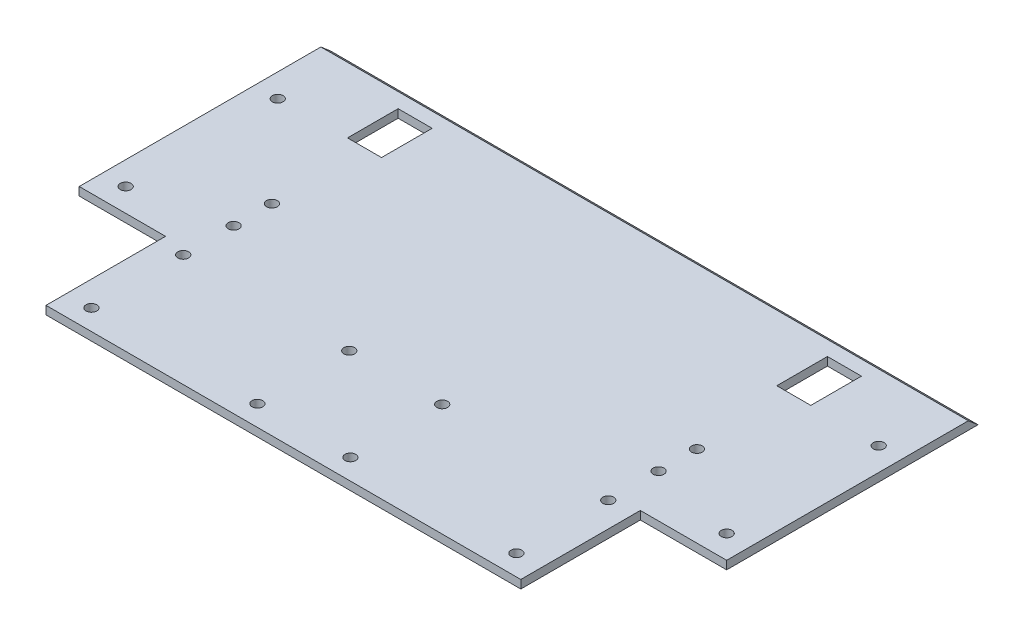
ISO-10303-21;
HEADER;
FILE_DESCRIPTION(('STEP AP214'),'2;1');
FILE_NAME('part.step','',(''),(''),'','','');
FILE_SCHEMA(('AUTOMOTIVE_DESIGN { 1 0 10303 214 1 1 1 1 }'));
ENDSEC;
DATA;
#1=APPLICATION_CONTEXT('core data for automotive mechanical design processes');
#2=APPLICATION_PROTOCOL_DEFINITION('international standard','automotive_design',2000,#1);
#3=PRODUCT_CONTEXT('',#1,'mechanical');
#4=PRODUCT('Part','Part','',(#3));
#5=PRODUCT_RELATED_PRODUCT_CATEGORY('part','',(#4));
#6=PRODUCT_DEFINITION_FORMATION('','',#4);
#7=PRODUCT_DEFINITION_CONTEXT('part definition',#1,'design');
#8=PRODUCT_DEFINITION('design','',#6,#7);
#9=PRODUCT_DEFINITION_SHAPE('','',#8);
#10=(LENGTH_UNIT() NAMED_UNIT(*) SI_UNIT(.MILLI.,.METRE.));
#11=(NAMED_UNIT(*) PLANE_ANGLE_UNIT() SI_UNIT($,.RADIAN.));
#12=(NAMED_UNIT(*) SI_UNIT($,.STERADIAN.) SOLID_ANGLE_UNIT());
#13=UNCERTAINTY_MEASURE_WITH_UNIT(LENGTH_MEASURE(1.E-05),#10,'distance_accuracy_value','');
#14=(GEOMETRIC_REPRESENTATION_CONTEXT(3) GLOBAL_UNCERTAINTY_ASSIGNED_CONTEXT((#13)) GLOBAL_UNIT_ASSIGNED_CONTEXT((#10,
#11,#12)) REPRESENTATION_CONTEXT('',''));
#15=CARTESIAN_POINT('',(0.,0.,0.));
#16=DIRECTION('',(0.,0.,1.));
#17=DIRECTION('',(1.,0.,0.));
#18=AXIS2_PLACEMENT_3D('',#15,#16,#17);
#19=CARTESIAN_POINT('',(-97.5,2.5,0.));
#20=DIRECTION('',(-1.,0.,0.));
#21=DIRECTION('',(0.,0.,1.));
#22=AXIS2_PLACEMENT_3D('',#19,#20,#21);
#23=PLANE('',#22);
#24=DIRECTION('',(0.,0.,-1.));
#25=VECTOR('',#24,1.);
#26=CARTESIAN_POINT('',(-97.5,0.,0.));
#27=LINE('',#26,#25);
#28=CARTESIAN_POINT('',(-97.5,0.,25.0000000000045));
#29=VERTEX_POINT('',#28);
#30=CARTESIAN_POINT('',(-97.5,0.,-50.6999999999954));
#31=VERTEX_POINT('',#30);
#32=EDGE_CURVE('E278',#29,#31,#27,.T.);
#33=ORIENTED_EDGE('',*,*,#32,.F.);
#34=DIRECTION('',(0.,-1.,0.));
#35=VECTOR('',#34,1.);
#36=CARTESIAN_POINT('',(-97.5,2.5,25.0000000000045));
#37=LINE('',#36,#35);
#38=CARTESIAN_POINT('',(-97.5,2.5,25.0000000000045));
#39=VERTEX_POINT('',#38);
#40=EDGE_CURVE('E13',#39,#29,#37,.T.);
#41=ORIENTED_EDGE('',*,*,#40,.F.);
#42=DIRECTION('',(0.,0.,-1.));
#43=VECTOR('',#42,1.);
#44=CARTESIAN_POINT('',(-97.5,2.5,0.));
#45=LINE('',#44,#43);
#46=CARTESIAN_POINT('',(-97.5,2.50000000000003,-47.7831999517202));
#47=VERTEX_POINT('',#46);
#48=EDGE_CURVE('E281',#39,#47,#45,.T.);
#49=ORIENTED_EDGE('',*,*,#48,.T.);
#50=DIRECTION('',(0.,0.650774217265846,0.759271307334885));
#51=VECTOR('',#50,1.);
#52=CARTESIAN_POINT('',(-97.5,2.50000000000001,-47.7831999517203));
#53=LINE('',#52,#51);
#54=EDGE_CURVE('E272',#31,#47,#53,.T.);
#55=ORIENTED_EDGE('',*,*,#54,.F.);
#56=EDGE_LOOP('',(#33,#41,#49,#55));
#57=FACE_BOUND('',#56,.T.);
#58=ADVANCED_FACE('F46',(#57),#23,.T.);
#59=CARTESIAN_POINT('',(0.,2.5,25.0000000000045));
#60=DIRECTION('',(0.,0.,1.));
#61=DIRECTION('',(1.,0.,0.));
#62=AXIS2_PLACEMENT_3D('',#59,#60,#61);
#63=PLANE('',#62);
#64=DIRECTION('',(-1.,0.,0.));
#65=VECTOR('',#64,1.);
#66=CARTESIAN_POINT('',(0.,0.,25.0000000000045));
#67=LINE('',#66,#65);
#68=CARTESIAN_POINT('',(-71.5,0.,25.0000000000045));
#69=VERTEX_POINT('',#68);
#70=EDGE_CURVE('E306',#69,#29,#67,.T.);
#71=ORIENTED_EDGE('',*,*,#70,.F.);
#72=DIRECTION('',(0.,-1.,0.));
#73=VECTOR('',#72,1.);
#74=CARTESIAN_POINT('',(-71.5,2.5,25.0000000000045));
#75=LINE('',#74,#73);
#76=CARTESIAN_POINT('',(-71.5,2.5,25.0000000000045));
#77=VERTEX_POINT('',#76);
#78=EDGE_CURVE('E54',#77,#69,#75,.T.);
#79=ORIENTED_EDGE('',*,*,#78,.F.);
#80=DIRECTION('',(-1.,0.,0.));
#81=VECTOR('',#80,1.);
#82=CARTESIAN_POINT('',(0.,2.5,25.0000000000045));
#83=LINE('',#82,#81);
#84=EDGE_CURVE('E283',#77,#39,#83,.T.);
#85=ORIENTED_EDGE('',*,*,#84,.T.);
#86=ORIENTED_EDGE('',*,*,#40,.T.);
#87=EDGE_LOOP('',(#71,#79,#85,#86));
#88=FACE_BOUND('',#87,.T.);
#89=ADVANCED_FACE('F431',(#88),#63,.T.);
#90=CARTESIAN_POINT('',(-71.5,2.5,0.));
#91=DIRECTION('',(-1.,0.,0.));
#92=DIRECTION('',(0.,0.,1.));
#93=AXIS2_PLACEMENT_3D('',#90,#91,#92);
#94=PLANE('',#93);
#95=DIRECTION('',(0.,0.,-1.));
#96=VECTOR('',#95,1.);
#97=CARTESIAN_POINT('',(-71.5,0.,0.));
#98=LINE('',#97,#96);
#99=CARTESIAN_POINT('',(-71.5,0.,61.0000000000045));
#100=VERTEX_POINT('',#99);
#101=EDGE_CURVE('E309',#100,#69,#98,.T.);
#102=ORIENTED_EDGE('',*,*,#101,.F.);
#103=DIRECTION('',(0.,-1.,0.));
#104=VECTOR('',#103,1.);
#105=CARTESIAN_POINT('',(-71.5,2.5,61.0000000000045));
#106=LINE('',#105,#104);
#107=CARTESIAN_POINT('',(-71.5,2.5,61.0000000000045));
#108=VERTEX_POINT('',#107);
#109=EDGE_CURVE('E333',#108,#100,#106,.T.);
#110=ORIENTED_EDGE('',*,*,#109,.F.);
#111=DIRECTION('',(0.,0.,-1.));
#112=VECTOR('',#111,1.);
#113=CARTESIAN_POINT('',(-71.5,2.5,0.));
#114=LINE('',#113,#112);
#115=EDGE_CURVE('E287',#108,#77,#114,.T.);
#116=ORIENTED_EDGE('',*,*,#115,.T.);
#117=ORIENTED_EDGE('',*,*,#78,.T.);
#118=EDGE_LOOP('',(#102,#110,#116,#117));
#119=FACE_BOUND('',#118,.T.);
#120=ADVANCED_FACE('F436',(#119),#94,.T.);
#121=CARTESIAN_POINT('',(0.,2.5,61.0000000000045));
#122=DIRECTION('',(0.,0.,-1.));
#123=DIRECTION('',(-1.,0.,0.));
#124=AXIS2_PLACEMENT_3D('',#121,#122,#123);
#125=PLANE('',#124);
#126=DIRECTION('',(1.,0.,0.));
#127=VECTOR('',#126,1.);
#128=CARTESIAN_POINT('',(0.,0.,61.0000000000045));
#129=LINE('',#128,#127);
#130=CARTESIAN_POINT('',(71.5,0.,61.0000000000045));
#131=VERTEX_POINT('',#130);
#132=EDGE_CURVE('E312',#100,#131,#129,.T.);
#133=ORIENTED_EDGE('',*,*,#132,.T.);
#134=DIRECTION('',(0.,-1.,0.));
#135=VECTOR('',#134,1.);
#136=CARTESIAN_POINT('',(71.5,2.5,61.0000000000045));
#137=LINE('',#136,#135);
#138=CARTESIAN_POINT('',(71.5,2.5,61.0000000000045));
#139=VERTEX_POINT('',#138);
#140=EDGE_CURVE('E330',#139,#131,#137,.T.);
#141=ORIENTED_EDGE('',*,*,#140,.F.);
#142=DIRECTION('',(1.,0.,0.));
#143=VECTOR('',#142,1.);
#144=CARTESIAN_POINT('',(0.,2.5,61.0000000000045));
#145=LINE('',#144,#143);
#146=EDGE_CURVE('E290',#108,#139,#145,.T.);
#147=ORIENTED_EDGE('',*,*,#146,.F.);
#148=ORIENTED_EDGE('',*,*,#109,.T.);
#149=EDGE_LOOP('',(#133,#141,#147,#148));
#150=FACE_BOUND('',#149,.T.);
#151=ADVANCED_FACE('F452',(#150),#125,.F.);
#152=CARTESIAN_POINT('',(71.5,2.5,0.));
#153=DIRECTION('',(-1.,0.,0.));
#154=DIRECTION('',(0.,0.,1.));
#155=AXIS2_PLACEMENT_3D('',#152,#153,#154);
#156=PLANE('',#155);
#157=DIRECTION('',(0.,0.,-1.));
#158=VECTOR('',#157,1.);
#159=CARTESIAN_POINT('',(71.5,0.,0.));
#160=LINE('',#159,#158);
#161=CARTESIAN_POINT('',(71.5,0.,25.0000000000045));
#162=VERTEX_POINT('',#161);
#163=EDGE_CURVE('E314',#131,#162,#160,.T.);
#164=ORIENTED_EDGE('',*,*,#163,.T.);
#165=DIRECTION('',(0.,-1.,0.));
#166=VECTOR('',#165,1.);
#167=CARTESIAN_POINT('',(71.5,2.5,25.0000000000045));
#168=LINE('',#167,#166);
#169=CARTESIAN_POINT('',(71.5,2.5,25.0000000000045));
#170=VERTEX_POINT('',#169);
#171=EDGE_CURVE('E327',#170,#162,#168,.T.);
#172=ORIENTED_EDGE('',*,*,#171,.F.);
#173=DIRECTION('',(0.,0.,-1.));
#174=VECTOR('',#173,1.);
#175=CARTESIAN_POINT('',(71.5,2.5,0.));
#176=LINE('',#175,#174);
#177=EDGE_CURVE('E292',#139,#170,#176,.T.);
#178=ORIENTED_EDGE('',*,*,#177,.F.);
#179=ORIENTED_EDGE('',*,*,#140,.T.);
#180=EDGE_LOOP('',(#164,#172,#178,#179));
#181=FACE_BOUND('',#180,.T.);
#182=ADVANCED_FACE('F458',(#181),#156,.F.);
#183=CARTESIAN_POINT('',(0.,2.5,25.0000000000045));
#184=DIRECTION('',(0.,0.,-1.));
#185=DIRECTION('',(-1.,0.,0.));
#186=AXIS2_PLACEMENT_3D('',#183,#184,#185);
#187=PLANE('',#186);
#188=DIRECTION('',(1.,0.,0.));
#189=VECTOR('',#188,1.);
#190=CARTESIAN_POINT('',(0.,0.,25.0000000000045));
#191=LINE('',#190,#189);
#192=CARTESIAN_POINT('',(97.5,0.,25.0000000000045));
#193=VERTEX_POINT('',#192);
#194=EDGE_CURVE('E316',#162,#193,#191,.T.);
#195=ORIENTED_EDGE('',*,*,#194,.T.);
#196=DIRECTION('',(0.,-1.,0.));
#197=VECTOR('',#196,1.);
#198=CARTESIAN_POINT('',(97.5,2.5,25.0000000000045));
#199=LINE('',#198,#197);
#200=CARTESIAN_POINT('',(97.5,2.5,25.0000000000045));
#201=VERTEX_POINT('',#200);
#202=EDGE_CURVE('E304',#201,#193,#199,.T.);
#203=ORIENTED_EDGE('',*,*,#202,.F.);
#204=DIRECTION('',(1.,0.,0.));
#205=VECTOR('',#204,1.);
#206=CARTESIAN_POINT('',(0.,2.5,25.0000000000045));
#207=LINE('',#206,#205);
#208=EDGE_CURVE('E294',#170,#201,#207,.T.);
#209=ORIENTED_EDGE('',*,*,#208,.F.);
#210=ORIENTED_EDGE('',*,*,#171,.T.);
#211=EDGE_LOOP('',(#195,#203,#209,#210));
#212=FACE_BOUND('',#211,.T.);
#213=ADVANCED_FACE('F462',(#212),#187,.F.);
#214=CARTESIAN_POINT('',(90.5,2.5,18.0000000000045));
#215=DIRECTION('',(0.,-1.,0.));
#216=DIRECTION('',(0.,0.,-1.));
#217=AXIS2_PLACEMENT_3D('',#214,#215,#216);
#218=CYLINDRICAL_SURFACE('',#217,1.625);
#219=CARTESIAN_POINT('',(90.5,2.5,18.0000000000045));
#220=DIRECTION('',(0.,1.,0.));
#221=DIRECTION('',(0.,0.,1.));
#222=AXIS2_PLACEMENT_3D('',#219,#220,#221);
#223=CIRCLE('',#222,1.625);
#224=CARTESIAN_POINT('',(90.5,2.5,19.6250000000045));
#225=VERTEX_POINT('',#224);
#226=EDGE_CURVE('E298',#225,#225,#223,.T.);
#227=ORIENTED_EDGE('',*,*,#226,.T.);
#228=EDGE_LOOP('',(#227));
#229=FACE_BOUND('',#228,.T.);
#230=CARTESIAN_POINT('',(90.5,0.,18.0000000000045));
#231=DIRECTION('',(0.,1.,0.));
#232=DIRECTION('',(0.,0.,1.));
#233=AXIS2_PLACEMENT_3D('',#230,#231,#232);
#234=CIRCLE('',#233,1.625);
#235=CARTESIAN_POINT('',(90.5,0.,19.6250000000045));
#236=VERTEX_POINT('',#235);
#237=EDGE_CURVE('E320',#236,#236,#234,.T.);
#238=ORIENTED_EDGE('',*,*,#237,.F.);
#239=EDGE_LOOP('',(#238));
#240=FACE_BOUND('',#239,.T.);
#241=ADVANCED_FACE('F425',(#229,#240),#218,.F.);
#242=CARTESIAN_POINT('',(97.5,2.5,0.));
#243=DIRECTION('',(-1.,0.,0.));
#244=DIRECTION('',(0.,0.,1.));
#245=AXIS2_PLACEMENT_3D('',#242,#243,#244);
#246=PLANE('',#245);
#247=DIRECTION('',(0.,0.,-1.));
#248=VECTOR('',#247,1.);
#249=CARTESIAN_POINT('',(97.5,0.,0.));
#250=LINE('',#249,#248);
#251=CARTESIAN_POINT('',(97.5,0.,-50.6999999999955));
#252=VERTEX_POINT('',#251);
#253=EDGE_CURVE('E318',#193,#252,#250,.T.);
#254=ORIENTED_EDGE('',*,*,#253,.T.);
#255=DIRECTION('',(0.,0.650774217265846,0.759271307334885));
#256=VECTOR('',#255,1.);
#257=CARTESIAN_POINT('',(97.5,2.5,-47.7831999517204));
#258=LINE('',#257,#256);
#259=CARTESIAN_POINT('',(97.5,2.5,-47.7831999517204));
#260=VERTEX_POINT('',#259);
#261=EDGE_CURVE('E267',#252,#260,#258,.T.);
#262=ORIENTED_EDGE('',*,*,#261,.T.);
#263=DIRECTION('',(0.,0.,-1.));
#264=VECTOR('',#263,1.);
#265=CARTESIAN_POINT('',(97.5,2.5,0.));
#266=LINE('',#265,#264);
#267=EDGE_CURVE('E296',#201,#260,#266,.T.);
#268=ORIENTED_EDGE('',*,*,#267,.F.);
#269=ORIENTED_EDGE('',*,*,#202,.T.);
#270=EDGE_LOOP('',(#254,#262,#268,#269));
#271=FACE_BOUND('',#270,.T.);
#272=ADVANCED_FACE('F416',(#271),#246,.F.);
#273=CARTESIAN_POINT('',(-90.5,2.5,18.0000000000045));
#274=DIRECTION('',(0.,-1.,0.));
#275=DIRECTION('',(0.,0.,-1.));
#276=AXIS2_PLACEMENT_3D('',#273,#274,#275);
#277=CYLINDRICAL_SURFACE('',#276,1.625);
#278=CARTESIAN_POINT('',(-90.5,2.5,18.0000000000045));
#279=DIRECTION('',(0.,1.,0.));
#280=DIRECTION('',(0.,0.,1.));
#281=AXIS2_PLACEMENT_3D('',#278,#279,#280);
#282=CIRCLE('',#281,1.625);
#283=CARTESIAN_POINT('',(-90.5,2.5,19.6250000000045));
#284=VERTEX_POINT('',#283);
#285=EDGE_CURVE('E301',#284,#284,#282,.F.);
#286=ORIENTED_EDGE('',*,*,#285,.F.);
#287=EDGE_LOOP('',(#286));
#288=FACE_BOUND('',#287,.T.);
#289=CARTESIAN_POINT('',(-90.5,0.,18.0000000000045));
#290=DIRECTION('',(0.,1.,0.));
#291=DIRECTION('',(0.,0.,1.));
#292=AXIS2_PLACEMENT_3D('',#289,#290,#291);
#293=CIRCLE('',#292,1.625);
#294=CARTESIAN_POINT('',(-90.5,0.,19.6250000000045));
#295=VERTEX_POINT('',#294);
#296=EDGE_CURVE('E284',#295,#295,#293,.F.);
#297=ORIENTED_EDGE('',*,*,#296,.T.);
#298=EDGE_LOOP('',(#297));
#299=FACE_BOUND('',#298,.T.);
#300=ADVANCED_FACE('F414',(#288,#299),#277,.F.);
#301=CARTESIAN_POINT('',(0.,2.5,0.));
#302=DIRECTION('',(0.,1.,0.));
#303=DIRECTION('',(0.,0.,1.));
#304=AXIS2_PLACEMENT_3D('',#301,#302,#303);
#305=PLANE('',#304);
#306=DIRECTION('',(0.,0.,-1.));
#307=VECTOR('',#306,1.);
#308=CARTESIAN_POINT('',(-59.5180736102201,2.5,0.));
#309=LINE('',#308,#307);
#310=CARTESIAN_POINT('',(-59.5180736102202,2.5,-28.0749999999954));
#311=VERTEX_POINT('',#310);
#312=CARTESIAN_POINT('',(-59.5180736102202,2.5,-43.3249999999954));
#313=VERTEX_POINT('',#312);
#314=EDGE_CURVE('E221',#311,#313,#309,.T.);
#315=ORIENTED_EDGE('',*,*,#314,.F.);
#316=DIRECTION('',(1.,0.,0.));
#317=VECTOR('',#316,1.);
#318=CARTESIAN_POINT('',(0.,2.5,-28.0749999999954));
#319=LINE('',#318,#317);
#320=CARTESIAN_POINT('',(-69.7680736102202,2.5,-28.0749999999954));
#321=VERTEX_POINT('',#320);
#322=EDGE_CURVE('E216',#321,#311,#319,.T.);
#323=ORIENTED_EDGE('',*,*,#322,.F.);
#324=DIRECTION('',(0.,0.,1.));
#325=VECTOR('',#324,1.);
#326=CARTESIAN_POINT('',(-69.7680736102202,2.5,0.));
#327=LINE('',#326,#325);
#328=CARTESIAN_POINT('',(-69.7680736102202,2.5,-43.3249999999954));
#329=VERTEX_POINT('',#328);
#330=EDGE_CURVE('E164',#329,#321,#327,.T.);
#331=ORIENTED_EDGE('',*,*,#330,.F.);
#332=DIRECTION('',(-1.,0.,0.));
#333=VECTOR('',#332,1.);
#334=CARTESIAN_POINT('',(0.,2.5,-43.3249999999954));
#335=LINE('',#334,#333);
#336=EDGE_CURVE('E219',#313,#329,#335,.T.);
#337=ORIENTED_EDGE('',*,*,#336,.F.);
#338=EDGE_LOOP('',(#315,#323,#331,#337));
#339=FACE_BOUND('',#338,.T.);
#340=DIRECTION('',(0.,0.,-1.));
#341=VECTOR('',#340,1.);
#342=CARTESIAN_POINT('',(69.7680736102202,2.5,0.));
#343=LINE('',#342,#341);
#344=CARTESIAN_POINT('',(69.7680736102202,2.5,-28.0749999999954));
#345=VERTEX_POINT('',#344);
#346=CARTESIAN_POINT('',(69.7680736102202,2.5,-43.3249999999954));
#347=VERTEX_POINT('',#346);
#348=EDGE_CURVE('E214',#345,#347,#343,.T.);
#349=ORIENTED_EDGE('',*,*,#348,.F.);
#350=DIRECTION('',(1.,0.,0.));
#351=VECTOR('',#350,1.);
#352=CARTESIAN_POINT('',(0.,2.5,-28.0749999999954));
#353=LINE('',#352,#351);
#354=CARTESIAN_POINT('',(59.5180736102202,2.5,-28.0749999999954));
#355=VERTEX_POINT('',#354);
#356=EDGE_CURVE('E188',#355,#345,#353,.T.);
#357=ORIENTED_EDGE('',*,*,#356,.F.);
#358=DIRECTION('',(0.,0.,1.));
#359=VECTOR('',#358,1.);
#360=CARTESIAN_POINT('',(59.5180736102201,2.5,0.));
#361=LINE('',#360,#359);
#362=CARTESIAN_POINT('',(59.5180736102202,2.5,-43.3249999999954));
#363=VERTEX_POINT('',#362);
#364=EDGE_CURVE('E210',#363,#355,#361,.T.);
#365=ORIENTED_EDGE('',*,*,#364,.F.);
#366=DIRECTION('',(-1.,0.,0.));
#367=VECTOR('',#366,1.);
#368=CARTESIAN_POINT('',(0.,2.5,-43.3249999999954));
#369=LINE('',#368,#367);
#370=EDGE_CURVE('E212',#347,#363,#369,.T.);
#371=ORIENTED_EDGE('',*,*,#370,.F.);
#372=EDGE_LOOP('',(#349,#357,#365,#371));
#373=FACE_BOUND('',#372,.T.);
#374=CARTESIAN_POINT('',(14.,2.5,27.1754000000041));
#375=DIRECTION('',(0.,-1.,0.));
#376=DIRECTION('',(0.,0.,-1.));
#377=AXIS2_PLACEMENT_3D('',#374,#375,#376);
#378=CIRCLE('',#377,1.625);
#379=CARTESIAN_POINT('',(14.,2.5,25.5504000000041));
#380=VERTEX_POINT('',#379);
#381=EDGE_CURVE('E227',#380,#380,#378,.T.);
#382=ORIENTED_EDGE('',*,*,#381,.T.);
#383=EDGE_LOOP('',(#382));
#384=FACE_BOUND('',#383,.T.);
#385=CARTESIAN_POINT('',(-64.,2.5,27.1754000000044));
#386=DIRECTION('',(0.,-1.,0.));
#387=DIRECTION('',(0.,0.,1.));
#388=AXIS2_PLACEMENT_3D('',#385,#386,#387);
#389=CIRCLE('',#388,1.625);
#390=CARTESIAN_POINT('',(-64.,2.5,28.8004000000044));
#391=VERTEX_POINT('',#390);
#392=EDGE_CURVE('E240',#391,#391,#389,.T.);
#393=ORIENTED_EDGE('',*,*,#392,.T.);
#394=EDGE_LOOP('',(#393));
#395=FACE_BOUND('',#394,.T.);
#396=CARTESIAN_POINT('',(-64.,2.5,54.8245000000044));
#397=DIRECTION('',(0.,-1.,0.));
#398=DIRECTION('',(0.,0.,1.));
#399=AXIS2_PLACEMENT_3D('',#396,#397,#398);
#400=CIRCLE('',#399,1.625);
#401=CARTESIAN_POINT('',(-64.,2.5,56.4495000000044));
#402=VERTEX_POINT('',#401);
#403=EDGE_CURVE('E237',#402,#402,#400,.T.);
#404=ORIENTED_EDGE('',*,*,#403,.T.);
#405=EDGE_LOOP('',(#404));
#406=FACE_BOUND('',#405,.T.);
#407=CARTESIAN_POINT('',(64.,2.5,54.8245000000045));
#408=DIRECTION('',(0.,-1.,0.));
#409=DIRECTION('',(0.,0.,-1.));
#410=AXIS2_PLACEMENT_3D('',#407,#408,#409);
#411=CIRCLE('',#410,1.625);
#412=CARTESIAN_POINT('',(64.,2.5,53.1995000000045));
#413=VERTEX_POINT('',#412);
#414=EDGE_CURVE('E233',#413,#413,#411,.T.);
#415=ORIENTED_EDGE('',*,*,#414,.T.);
#416=EDGE_LOOP('',(#415));
#417=FACE_BOUND('',#416,.T.);
#418=CARTESIAN_POINT('',(-64.,2.5,12.0000000000045));
#419=DIRECTION('',(0.,-1.,0.));
#420=DIRECTION('',(0.,0.,1.));
#421=AXIS2_PLACEMENT_3D('',#418,#419,#420);
#422=CIRCLE('',#421,1.625);
#423=CARTESIAN_POINT('',(-64.,2.5,13.6250000000045));
#424=VERTEX_POINT('',#423);
#425=EDGE_CURVE('E236',#424,#424,#422,.T.);
#426=ORIENTED_EDGE('',*,*,#425,.T.);
#427=EDGE_LOOP('',(#426));
#428=FACE_BOUND('',#427,.T.);
#429=CARTESIAN_POINT('',(-64.,2.5,0.460000000004494));
#430=DIRECTION('',(0.,-1.,0.));
#431=DIRECTION('',(0.,0.,1.));
#432=AXIS2_PLACEMENT_3D('',#429,#430,#431);
#433=CIRCLE('',#432,1.625);
#434=CARTESIAN_POINT('',(-64.,2.5,2.0850000000045));
#435=VERTEX_POINT('',#434);
#436=EDGE_CURVE('E252',#435,#435,#433,.T.);
#437=ORIENTED_EDGE('',*,*,#436,.T.);
#438=EDGE_LOOP('',(#437));
#439=FACE_BOUND('',#438,.T.);
#440=CARTESIAN_POINT('',(64.,2.5,27.1754000000045));
#441=DIRECTION('',(0.,-1.,0.));
#442=DIRECTION('',(0.,0.,-1.));
#443=AXIS2_PLACEMENT_3D('',#440,#441,#442);
#444=CIRCLE('',#443,1.625);
#445=CARTESIAN_POINT('',(64.,2.5,25.5504000000045));
#446=VERTEX_POINT('',#445);
#447=EDGE_CURVE('E249',#446,#446,#444,.T.);
#448=ORIENTED_EDGE('',*,*,#447,.T.);
#449=EDGE_LOOP('',(#448));
#450=FACE_BOUND('',#449,.T.);
#451=CARTESIAN_POINT('',(64.,2.5,12.0000000000045));
#452=DIRECTION('',(0.,-1.,0.));
#453=DIRECTION('',(0.,0.,-1.));
#454=AXIS2_PLACEMENT_3D('',#451,#452,#453);
#455=CIRCLE('',#454,1.625);
#456=CARTESIAN_POINT('',(64.,2.5,10.3750000000045));
#457=VERTEX_POINT('',#456);
#458=EDGE_CURVE('E245',#457,#457,#455,.T.);
#459=ORIENTED_EDGE('',*,*,#458,.T.);
#460=EDGE_LOOP('',(#459));
#461=FACE_BOUND('',#460,.T.);
#462=CARTESIAN_POINT('',(14.,2.5,54.8245000000042));
#463=DIRECTION('',(0.,-1.,0.));
#464=DIRECTION('',(0.,0.,-1.));
#465=AXIS2_PLACEMENT_3D('',#462,#463,#464);
#466=CIRCLE('',#465,1.625);
#467=CARTESIAN_POINT('',(14.,2.5,53.1995000000041));
#468=VERTEX_POINT('',#467);
#469=EDGE_CURVE('E224',#468,#468,#466,.T.);
#470=ORIENTED_EDGE('',*,*,#469,.T.);
#471=EDGE_LOOP('',(#470));
#472=FACE_BOUND('',#471,.T.);
#473=CARTESIAN_POINT('',(-14.,2.5,54.8245000000041));
#474=DIRECTION('',(0.,-1.,0.));
#475=DIRECTION('',(0.,0.,1.));
#476=AXIS2_PLACEMENT_3D('',#473,#474,#475);
#477=CIRCLE('',#476,1.625);
#478=CARTESIAN_POINT('',(-14.,2.5,56.4495000000041));
#479=VERTEX_POINT('',#478);
#480=EDGE_CURVE('E228',#479,#479,#477,.T.);
#481=ORIENTED_EDGE('',*,*,#480,.T.);
#482=EDGE_LOOP('',(#481));
#483=FACE_BOUND('',#482,.T.);
#484=CARTESIAN_POINT('',(-14.,2.5,27.1754000000041));
#485=DIRECTION('',(0.,-1.,0.));
#486=DIRECTION('',(0.,0.,1.));
#487=AXIS2_PLACEMENT_3D('',#484,#485,#486);
#488=CIRCLE('',#487,1.625);
#489=CARTESIAN_POINT('',(-14.,2.5,28.8004000000041));
#490=VERTEX_POINT('',#489);
#491=EDGE_CURVE('E223',#490,#490,#488,.T.);
#492=ORIENTED_EDGE('',*,*,#491,.T.);
#493=EDGE_LOOP('',(#492));
#494=FACE_BOUND('',#493,.T.);
#495=CARTESIAN_POINT('',(64.,2.5,0.460000000004494));
#496=DIRECTION('',(0.,-1.,0.));
#497=DIRECTION('',(0.,0.,-1.));
#498=AXIS2_PLACEMENT_3D('',#495,#496,#497);
#499=CIRCLE('',#498,1.625);
#500=CARTESIAN_POINT('',(64.,2.5,-1.16499999999551));
#501=VERTEX_POINT('',#500);
#502=EDGE_CURVE('E248',#501,#501,#499,.T.);
#503=ORIENTED_EDGE('',*,*,#502,.T.);
#504=EDGE_LOOP('',(#503));
#505=FACE_BOUND('',#504,.T.);
#506=CARTESIAN_POINT('',(90.5000000000001,2.5,-27.7831999517202));
#507=DIRECTION('',(0.,1.,0.));
#508=DIRECTION('',(0.,0.,1.));
#509=AXIS2_PLACEMENT_3D('',#506,#507,#508);
#510=CIRCLE('',#509,1.625);
#511=CARTESIAN_POINT('',(90.5000000000001,2.5,-26.1581999517202));
#512=VERTEX_POINT('',#511);
#513=EDGE_CURVE('E260',#512,#512,#510,.T.);
#514=ORIENTED_EDGE('',*,*,#513,.F.);
#515=EDGE_LOOP('',(#514));
#516=FACE_BOUND('',#515,.T.);
#517=CARTESIAN_POINT('',(-90.5000000000001,2.5,-27.7831999517202));
#518=DIRECTION('',(0.,1.,0.));
#519=DIRECTION('',(0.,0.,-1.));
#520=AXIS2_PLACEMENT_3D('',#517,#518,#519);
#521=CIRCLE('',#520,1.625);
#522=CARTESIAN_POINT('',(-90.5000000000001,2.5,-29.4081999517202));
#523=VERTEX_POINT('',#522);
#524=EDGE_CURVE('E264',#523,#523,#521,.T.);
#525=ORIENTED_EDGE('',*,*,#524,.F.);
#526=EDGE_LOOP('',(#525));
#527=FACE_BOUND('',#526,.T.);
#528=ORIENTED_EDGE('',*,*,#267,.T.);
#529=DIRECTION('',(1.,0.,0.));
#530=VECTOR('',#529,1.);
#531=CARTESIAN_POINT('',(-142.5693909433,2.5,-47.7831999517202));
#532=LINE('',#531,#530);
#533=EDGE_CURVE('E275',#47,#260,#532,.T.);
#534=ORIENTED_EDGE('',*,*,#533,.F.);
#535=ORIENTED_EDGE('',*,*,#48,.F.);
#536=ORIENTED_EDGE('',*,*,#84,.F.);
#537=ORIENTED_EDGE('',*,*,#115,.F.);
#538=ORIENTED_EDGE('',*,*,#146,.T.);
#539=ORIENTED_EDGE('',*,*,#177,.T.);
#540=ORIENTED_EDGE('',*,*,#208,.T.);
#541=EDGE_LOOP('',(#528,#534,#535,#536,#537,#538,#539,#540));
#542=FACE_BOUND('',#541,.T.);
#543=ORIENTED_EDGE('',*,*,#226,.F.);
#544=EDGE_LOOP('',(#543));
#545=FACE_BOUND('',#544,.T.);
#546=ORIENTED_EDGE('',*,*,#285,.T.);
#547=EDGE_LOOP('',(#546));
#548=FACE_BOUND('',#547,.T.);
#549=ADVANCED_FACE('F380',(#339,#373,#384,#395,#406,#417,#428,#439,#450,#461,#472,#483,#494,
#505,#516,#527,#542,#545,#548),#305,.T.);
#550=CARTESIAN_POINT('',(0.,0.,0.));
#551=DIRECTION('',(0.,1.,0.));
#552=DIRECTION('',(0.,0.,1.));
#553=AXIS2_PLACEMENT_3D('',#550,#551,#552);
#554=PLANE('',#553);
#555=DIRECTION('',(-1.,0.,0.));
#556=VECTOR('',#555,1.);
#557=CARTESIAN_POINT('',(-69.7680736102202,0.,-28.0749999999954));
#558=LINE('',#557,#556);
#559=CARTESIAN_POINT('',(-59.5180736102202,0.,-28.0749999999954));
#560=VERTEX_POINT('',#559);
#561=CARTESIAN_POINT('',(-69.7680736102202,0.,-28.0749999999954));
#562=VERTEX_POINT('',#561);
#563=EDGE_CURVE('E171',#560,#562,#558,.T.);
#564=ORIENTED_EDGE('',*,*,#563,.F.);
#565=DIRECTION('',(0.,0.,1.));
#566=VECTOR('',#565,1.);
#567=CARTESIAN_POINT('',(-59.5180736102202,0.,-28.0749999999954));
#568=LINE('',#567,#566);
#569=CARTESIAN_POINT('',(-59.5180736102202,0.,-43.3249999999954));
#570=VERTEX_POINT('',#569);
#571=EDGE_CURVE('E176',#570,#560,#568,.T.);
#572=ORIENTED_EDGE('',*,*,#571,.F.);
#573=DIRECTION('',(1.,0.,0.));
#574=VECTOR('',#573,1.);
#575=CARTESIAN_POINT('',(-69.7680736102202,0.,-43.3249999999954));
#576=LINE('',#575,#574);
#577=CARTESIAN_POINT('',(-69.7680736102202,0.,-43.3249999999954));
#578=VERTEX_POINT('',#577);
#579=EDGE_CURVE('E181',#578,#570,#576,.T.);
#580=ORIENTED_EDGE('',*,*,#579,.F.);
#581=DIRECTION('',(0.,0.,-1.));
#582=VECTOR('',#581,1.);
#583=CARTESIAN_POINT('',(-69.7680736102202,0.,-28.0749999999954));
#584=LINE('',#583,#582);
#585=EDGE_CURVE('E161',#562,#578,#584,.T.);
#586=ORIENTED_EDGE('',*,*,#585,.F.);
#587=EDGE_LOOP('',(#564,#572,#580,#586));
#588=FACE_BOUND('',#587,.T.);
#589=DIRECTION('',(-1.,0.,0.));
#590=VECTOR('',#589,1.);
#591=CARTESIAN_POINT('',(69.7680736102202,0.,-28.0749999999954));
#592=LINE('',#591,#590);
#593=CARTESIAN_POINT('',(69.7680736102202,0.,-28.0749999999954));
#594=VERTEX_POINT('',#593);
#595=CARTESIAN_POINT('',(59.5180736102202,0.,-28.0749999999954));
#596=VERTEX_POINT('',#595);
#597=EDGE_CURVE('E193',#594,#596,#592,.T.);
#598=ORIENTED_EDGE('',*,*,#597,.F.);
#599=DIRECTION('',(0.,0.,1.));
#600=VECTOR('',#599,1.);
#601=CARTESIAN_POINT('',(69.7680736102202,0.,-28.0749999999954));
#602=LINE('',#601,#600);
#603=CARTESIAN_POINT('',(69.7680736102202,0.,-43.3249999999954));
#604=VERTEX_POINT('',#603);
#605=EDGE_CURVE('E191',#604,#594,#602,.T.);
#606=ORIENTED_EDGE('',*,*,#605,.F.);
#607=DIRECTION('',(1.,0.,0.));
#608=VECTOR('',#607,1.);
#609=CARTESIAN_POINT('',(69.7680736102202,0.,-43.3249999999954));
#610=LINE('',#609,#608);
#611=CARTESIAN_POINT('',(59.5180736102202,0.,-43.3249999999954));
#612=VERTEX_POINT('',#611);
#613=EDGE_CURVE('E198',#612,#604,#610,.T.);
#614=ORIENTED_EDGE('',*,*,#613,.F.);
#615=DIRECTION('',(0.,0.,-1.));
#616=VECTOR('',#615,1.);
#617=CARTESIAN_POINT('',(59.5180736102202,0.,-28.0749999999954));
#618=LINE('',#617,#616);
#619=EDGE_CURVE('E195',#596,#612,#618,.T.);
#620=ORIENTED_EDGE('',*,*,#619,.F.);
#621=EDGE_LOOP('',(#598,#606,#614,#620));
#622=FACE_BOUND('',#621,.T.);
#623=CARTESIAN_POINT('',(14.,0.,27.1754000000041));
#624=DIRECTION('',(0.,1.,0.));
#625=DIRECTION('',(0.,0.,1.));
#626=AXIS2_PLACEMENT_3D('',#623,#624,#625);
#627=CIRCLE('',#626,1.625);
#628=CARTESIAN_POINT('',(14.,0.,28.8004000000041));
#629=VERTEX_POINT('',#628);
#630=EDGE_CURVE('E49',#629,#629,#627,.F.);
#631=ORIENTED_EDGE('',*,*,#630,.F.);
#632=EDGE_LOOP('',(#631));
#633=FACE_BOUND('',#632,.T.);
#634=CARTESIAN_POINT('',(-64.,0.,27.1754000000044));
#635=DIRECTION('',(0.,1.,0.));
#636=DIRECTION('',(0.,0.,1.));
#637=AXIS2_PLACEMENT_3D('',#634,#635,#636);
#638=CIRCLE('',#637,1.625);
#639=CARTESIAN_POINT('',(-64.,0.,28.8004000000044));
#640=VERTEX_POINT('',#639);
#641=EDGE_CURVE('E368',#640,#640,#638,.F.);
#642=ORIENTED_EDGE('',*,*,#641,.F.);
#643=EDGE_LOOP('',(#642));
#644=FACE_BOUND('',#643,.T.);
#645=CARTESIAN_POINT('',(-64.,0.,54.8245000000044));
#646=DIRECTION('',(0.,1.,0.));
#647=DIRECTION('',(0.,0.,1.));
#648=AXIS2_PLACEMENT_3D('',#645,#646,#647);
#649=CIRCLE('',#648,1.625);
#650=CARTESIAN_POINT('',(-64.,0.,56.4495000000044));
#651=VERTEX_POINT('',#650);
#652=EDGE_CURVE('E366',#651,#651,#649,.F.);
#653=ORIENTED_EDGE('',*,*,#652,.F.);
#654=EDGE_LOOP('',(#653));
#655=FACE_BOUND('',#654,.T.);
#656=CARTESIAN_POINT('',(64.,0.,54.8245000000045));
#657=DIRECTION('',(0.,1.,0.));
#658=DIRECTION('',(0.,0.,1.));
#659=AXIS2_PLACEMENT_3D('',#656,#657,#658);
#660=CIRCLE('',#659,1.625);
#661=CARTESIAN_POINT('',(64.,0.,56.4495000000045));
#662=VERTEX_POINT('',#661);
#663=EDGE_CURVE('E363',#662,#662,#660,.F.);
#664=ORIENTED_EDGE('',*,*,#663,.F.);
#665=EDGE_LOOP('',(#664));
#666=FACE_BOUND('',#665,.T.);
#667=CARTESIAN_POINT('',(-64.,0.,12.0000000000045));
#668=DIRECTION('',(0.,1.,0.));
#669=DIRECTION('',(0.,0.,1.));
#670=AXIS2_PLACEMENT_3D('',#667,#668,#669);
#671=CIRCLE('',#670,1.625);
#672=CARTESIAN_POINT('',(-64.,0.,13.6250000000045));
#673=VERTEX_POINT('',#672);
#674=EDGE_CURVE('E360',#673,#673,#671,.F.);
#675=ORIENTED_EDGE('',*,*,#674,.F.);
#676=EDGE_LOOP('',(#675));
#677=FACE_BOUND('',#676,.T.);
#678=CARTESIAN_POINT('',(-64.,0.,0.460000000004494));
#679=DIRECTION('',(0.,1.,0.));
#680=DIRECTION('',(0.,0.,1.));
#681=AXIS2_PLACEMENT_3D('',#678,#679,#680);
#682=CIRCLE('',#681,1.625);
#683=CARTESIAN_POINT('',(-64.,0.,2.0850000000045));
#684=VERTEX_POINT('',#683);
#685=EDGE_CURVE('E357',#684,#684,#682,.F.);
#686=ORIENTED_EDGE('',*,*,#685,.F.);
#687=EDGE_LOOP('',(#686));
#688=FACE_BOUND('',#687,.T.);
#689=CARTESIAN_POINT('',(64.,0.,27.1754000000045));
#690=DIRECTION('',(0.,1.,0.));
#691=DIRECTION('',(0.,0.,1.));
#692=AXIS2_PLACEMENT_3D('',#689,#690,#691);
#693=CIRCLE('',#692,1.625);
#694=CARTESIAN_POINT('',(64.,0.,28.8004000000045));
#695=VERTEX_POINT('',#694);
#696=EDGE_CURVE('E354',#695,#695,#693,.F.);
#697=ORIENTED_EDGE('',*,*,#696,.F.);
#698=EDGE_LOOP('',(#697));
#699=FACE_BOUND('',#698,.T.);
#700=CARTESIAN_POINT('',(64.,0.,12.0000000000045));
#701=DIRECTION('',(0.,1.,0.));
#702=DIRECTION('',(0.,0.,1.));
#703=AXIS2_PLACEMENT_3D('',#700,#701,#702);
#704=CIRCLE('',#703,1.625);
#705=CARTESIAN_POINT('',(64.,0.,13.6250000000045));
#706=VERTEX_POINT('',#705);
#707=EDGE_CURVE('E351',#706,#706,#704,.F.);
#708=ORIENTED_EDGE('',*,*,#707,.F.);
#709=EDGE_LOOP('',(#708));
#710=FACE_BOUND('',#709,.T.);
#711=CARTESIAN_POINT('',(14.,0.,54.8245000000042));
#712=DIRECTION('',(0.,1.,0.));
#713=DIRECTION('',(0.,0.,1.));
#714=AXIS2_PLACEMENT_3D('',#711,#712,#713);
#715=CIRCLE('',#714,1.625);
#716=CARTESIAN_POINT('',(14.,0.,56.4495000000042));
#717=VERTEX_POINT('',#716);
#718=EDGE_CURVE('E348',#717,#717,#715,.F.);
#719=ORIENTED_EDGE('',*,*,#718,.F.);
#720=EDGE_LOOP('',(#719));
#721=FACE_BOUND('',#720,.T.);
#722=CARTESIAN_POINT('',(-14.,0.,54.8245000000041));
#723=DIRECTION('',(0.,1.,0.));
#724=DIRECTION('',(0.,0.,1.));
#725=AXIS2_PLACEMENT_3D('',#722,#723,#724);
#726=CIRCLE('',#725,1.625);
#727=CARTESIAN_POINT('',(-14.,0.,56.4495000000041));
#728=VERTEX_POINT('',#727);
#729=EDGE_CURVE('E345',#728,#728,#726,.F.);
#730=ORIENTED_EDGE('',*,*,#729,.F.);
#731=EDGE_LOOP('',(#730));
#732=FACE_BOUND('',#731,.T.);
#733=CARTESIAN_POINT('',(-14.,0.,27.1754000000041));
#734=DIRECTION('',(0.,1.,0.));
#735=DIRECTION('',(0.,0.,1.));
#736=AXIS2_PLACEMENT_3D('',#733,#734,#735);
#737=CIRCLE('',#736,1.625);
#738=CARTESIAN_POINT('',(-14.,0.,28.8004000000041));
#739=VERTEX_POINT('',#738);
#740=EDGE_CURVE('E342',#739,#739,#737,.F.);
#741=ORIENTED_EDGE('',*,*,#740,.F.);
#742=EDGE_LOOP('',(#741));
#743=FACE_BOUND('',#742,.T.);
#744=CARTESIAN_POINT('',(64.,0.,0.460000000004494));
#745=DIRECTION('',(0.,1.,0.));
#746=DIRECTION('',(0.,0.,1.));
#747=AXIS2_PLACEMENT_3D('',#744,#745,#746);
#748=CIRCLE('',#747,1.625);
#749=CARTESIAN_POINT('',(64.,0.,2.0850000000045));
#750=VERTEX_POINT('',#749);
#751=EDGE_CURVE('E259',#750,#750,#748,.F.);
#752=ORIENTED_EDGE('',*,*,#751,.F.);
#753=EDGE_LOOP('',(#752));
#754=FACE_BOUND('',#753,.T.);
#755=CARTESIAN_POINT('',(90.5000000000001,0.,-27.7831999517202));
#756=DIRECTION('',(0.,1.,0.));
#757=DIRECTION('',(0.,0.,1.));
#758=AXIS2_PLACEMENT_3D('',#755,#756,#757);
#759=CIRCLE('',#758,1.625);
#760=CARTESIAN_POINT('',(90.5000000000001,0.,-26.1581999517202));
#761=VERTEX_POINT('',#760);
#762=EDGE_CURVE('E271',#761,#761,#759,.T.);
#763=ORIENTED_EDGE('',*,*,#762,.T.);
#764=EDGE_LOOP('',(#763));
#765=FACE_BOUND('',#764,.T.);
#766=CARTESIAN_POINT('',(-90.5000000000001,0.,-27.7831999517202));
#767=DIRECTION('',(0.,1.,0.));
#768=DIRECTION('',(0.,0.,1.));
#769=AXIS2_PLACEMENT_3D('',#766,#767,#768);
#770=CIRCLE('',#769,1.625);
#771=CARTESIAN_POINT('',(-90.5000000000001,0.,-26.1581999517202));
#772=VERTEX_POINT('',#771);
#773=EDGE_CURVE('E263',#772,#772,#770,.T.);
#774=ORIENTED_EDGE('',*,*,#773,.T.);
#775=EDGE_LOOP('',(#774));
#776=FACE_BOUND('',#775,.T.);
#777=ORIENTED_EDGE('',*,*,#32,.T.);
#778=DIRECTION('',(1.,0.,0.));
#779=VECTOR('',#778,1.);
#780=CARTESIAN_POINT('',(-142.5693909433,0.,-50.6999999999953));
#781=LINE('',#780,#779);
#782=EDGE_CURVE('E270',#31,#252,#781,.T.);
#783=ORIENTED_EDGE('',*,*,#782,.T.);
#784=ORIENTED_EDGE('',*,*,#253,.F.);
#785=ORIENTED_EDGE('',*,*,#194,.F.);
#786=ORIENTED_EDGE('',*,*,#163,.F.);
#787=ORIENTED_EDGE('',*,*,#132,.F.);
#788=ORIENTED_EDGE('',*,*,#101,.T.);
#789=ORIENTED_EDGE('',*,*,#70,.T.);
#790=EDGE_LOOP('',(#777,#783,#784,#785,#786,#787,#788,#789));
#791=FACE_BOUND('',#790,.T.);
#792=ORIENTED_EDGE('',*,*,#237,.T.);
#793=EDGE_LOOP('',(#792));
#794=FACE_BOUND('',#793,.T.);
#795=ORIENTED_EDGE('',*,*,#296,.F.);
#796=EDGE_LOOP('',(#795));
#797=FACE_BOUND('',#796,.T.);
#798=ADVANCED_FACE('F178',(#588,#622,#633,#644,#655,#666,#677,#688,#699,#710,#721,#732,#743,
#754,#765,#776,#791,#794,#797),#554,.F.);
#799=CARTESIAN_POINT('',(-142.5693909433,2.5,-47.7831999517202));
#800=DIRECTION('',(0.,0.759271307334885,-0.650774217265846));
#801=DIRECTION('',(0.,0.650774217265846,0.759271307334885));
#802=AXIS2_PLACEMENT_3D('',#799,#800,#801);
#803=PLANE('',#802);
#804=ORIENTED_EDGE('',*,*,#782,.F.);
#805=ORIENTED_EDGE('',*,*,#54,.T.);
#806=ORIENTED_EDGE('',*,*,#533,.T.);
#807=ORIENTED_EDGE('',*,*,#261,.F.);
#808=EDGE_LOOP('',(#804,#805,#806,#807));
#809=FACE_BOUND('',#808,.T.);
#810=ADVANCED_FACE('F379',(#809),#803,.T.);
#811=CARTESIAN_POINT('',(-90.5000000000001,-7.5,-27.7831999517202));
#812=DIRECTION('',(0.,1.,0.));
#813=DIRECTION('',(0.,0.,1.));
#814=AXIS2_PLACEMENT_3D('',#811,#812,#813);
#815=CYLINDRICAL_SURFACE('',#814,1.625);
#816=ORIENTED_EDGE('',*,*,#524,.T.);
#817=EDGE_LOOP('',(#816));
#818=FACE_BOUND('',#817,.T.);
#819=ORIENTED_EDGE('',*,*,#773,.F.);
#820=EDGE_LOOP('',(#819));
#821=FACE_BOUND('',#820,.T.);
#822=ADVANCED_FACE('F468',(#818,#821),#815,.F.);
#823=CARTESIAN_POINT('',(90.5000000000001,-7.5,-27.7831999517202));
#824=DIRECTION('',(0.,1.,0.));
#825=DIRECTION('',(0.,0.,1.));
#826=AXIS2_PLACEMENT_3D('',#823,#824,#825);
#827=CYLINDRICAL_SURFACE('',#826,1.625);
#828=ORIENTED_EDGE('',*,*,#513,.T.);
#829=EDGE_LOOP('',(#828));
#830=FACE_BOUND('',#829,.T.);
#831=ORIENTED_EDGE('',*,*,#762,.F.);
#832=EDGE_LOOP('',(#831));
#833=FACE_BOUND('',#832,.T.);
#834=ADVANCED_FACE('F473',(#830,#833),#827,.F.);
#835=CARTESIAN_POINT('',(64.,-7.5,0.460000000004494));
#836=DIRECTION('',(0.,1.,0.));
#837=DIRECTION('',(0.,0.,1.));
#838=AXIS2_PLACEMENT_3D('',#835,#836,#837);
#839=CYLINDRICAL_SURFACE('',#838,1.625);
#840=ORIENTED_EDGE('',*,*,#502,.F.);
#841=EDGE_LOOP('',(#840));
#842=FACE_BOUND('',#841,.T.);
#843=ORIENTED_EDGE('',*,*,#751,.T.);
#844=EDGE_LOOP('',(#843));
#845=FACE_BOUND('',#844,.T.);
#846=ADVANCED_FACE('F479',(#842,#845),#839,.F.);
#847=CARTESIAN_POINT('',(-14.,-7.5,27.1754000000041));
#848=DIRECTION('',(0.,1.,0.));
#849=DIRECTION('',(0.,0.,1.));
#850=AXIS2_PLACEMENT_3D('',#847,#848,#849);
#851=CYLINDRICAL_SURFACE('',#850,1.625);
#852=ORIENTED_EDGE('',*,*,#491,.F.);
#853=EDGE_LOOP('',(#852));
#854=FACE_BOUND('',#853,.T.);
#855=ORIENTED_EDGE('',*,*,#740,.T.);
#856=EDGE_LOOP('',(#855));
#857=FACE_BOUND('',#856,.T.);
#858=ADVANCED_FACE('F483',(#854,#857),#851,.F.);
#859=CARTESIAN_POINT('',(-14.,-7.5,54.8245000000041));
#860=DIRECTION('',(0.,1.,0.));
#861=DIRECTION('',(0.,0.,1.));
#862=AXIS2_PLACEMENT_3D('',#859,#860,#861);
#863=CYLINDRICAL_SURFACE('',#862,1.625);
#864=ORIENTED_EDGE('',*,*,#480,.F.);
#865=EDGE_LOOP('',(#864));
#866=FACE_BOUND('',#865,.T.);
#867=ORIENTED_EDGE('',*,*,#729,.T.);
#868=EDGE_LOOP('',(#867));
#869=FACE_BOUND('',#868,.T.);
#870=ADVANCED_FACE('F520',(#866,#869),#863,.F.);
#871=CARTESIAN_POINT('',(14.,-7.5,54.8245000000042));
#872=DIRECTION('',(0.,1.,0.));
#873=DIRECTION('',(0.,0.,1.));
#874=AXIS2_PLACEMENT_3D('',#871,#872,#873);
#875=CYLINDRICAL_SURFACE('',#874,1.625);
#876=ORIENTED_EDGE('',*,*,#469,.F.);
#877=EDGE_LOOP('',(#876));
#878=FACE_BOUND('',#877,.T.);
#879=ORIENTED_EDGE('',*,*,#718,.T.);
#880=EDGE_LOOP('',(#879));
#881=FACE_BOUND('',#880,.T.);
#882=ADVANCED_FACE('F501',(#878,#881),#875,.F.);
#883=CARTESIAN_POINT('',(64.,-7.5,12.0000000000045));
#884=DIRECTION('',(0.,1.,0.));
#885=DIRECTION('',(0.,0.,1.));
#886=AXIS2_PLACEMENT_3D('',#883,#884,#885);
#887=CYLINDRICAL_SURFACE('',#886,1.625);
#888=ORIENTED_EDGE('',*,*,#458,.F.);
#889=EDGE_LOOP('',(#888));
#890=FACE_BOUND('',#889,.T.);
#891=ORIENTED_EDGE('',*,*,#707,.T.);
#892=EDGE_LOOP('',(#891));
#893=FACE_BOUND('',#892,.T.);
#894=ADVANCED_FACE('F497',(#890,#893),#887,.F.);
#895=CARTESIAN_POINT('',(64.,-7.5,27.1754000000045));
#896=DIRECTION('',(0.,1.,0.));
#897=DIRECTION('',(0.,0.,1.));
#898=AXIS2_PLACEMENT_3D('',#895,#896,#897);
#899=CYLINDRICAL_SURFACE('',#898,1.625);
#900=ORIENTED_EDGE('',*,*,#447,.F.);
#901=EDGE_LOOP('',(#900));
#902=FACE_BOUND('',#901,.T.);
#903=ORIENTED_EDGE('',*,*,#696,.T.);
#904=EDGE_LOOP('',(#903));
#905=FACE_BOUND('',#904,.T.);
#906=ADVANCED_FACE('F493',(#902,#905),#899,.F.);
#907=CARTESIAN_POINT('',(-64.,-7.5,0.460000000004494));
#908=DIRECTION('',(0.,1.,0.));
#909=DIRECTION('',(0.,0.,1.));
#910=AXIS2_PLACEMENT_3D('',#907,#908,#909);
#911=CYLINDRICAL_SURFACE('',#910,1.625);
#912=ORIENTED_EDGE('',*,*,#436,.F.);
#913=EDGE_LOOP('',(#912));
#914=FACE_BOUND('',#913,.T.);
#915=ORIENTED_EDGE('',*,*,#685,.T.);
#916=EDGE_LOOP('',(#915));
#917=FACE_BOUND('',#916,.T.);
#918=ADVANCED_FACE('F489',(#914,#917),#911,.F.);
#919=CARTESIAN_POINT('',(-64.,-7.5,12.0000000000045));
#920=DIRECTION('',(0.,1.,0.));
#921=DIRECTION('',(0.,0.,1.));
#922=AXIS2_PLACEMENT_3D('',#919,#920,#921);
#923=CYLINDRICAL_SURFACE('',#922,1.625);
#924=ORIENTED_EDGE('',*,*,#425,.F.);
#925=EDGE_LOOP('',(#924));
#926=FACE_BOUND('',#925,.T.);
#927=ORIENTED_EDGE('',*,*,#674,.T.);
#928=EDGE_LOOP('',(#927));
#929=FACE_BOUND('',#928,.T.);
#930=ADVANCED_FACE('F485',(#926,#929),#923,.F.);
#931=CARTESIAN_POINT('',(64.,-7.5,54.8245000000045));
#932=DIRECTION('',(0.,1.,0.));
#933=DIRECTION('',(0.,0.,1.));
#934=AXIS2_PLACEMENT_3D('',#931,#932,#933);
#935=CYLINDRICAL_SURFACE('',#934,1.625);
#936=ORIENTED_EDGE('',*,*,#414,.F.);
#937=EDGE_LOOP('',(#936));
#938=FACE_BOUND('',#937,.T.);
#939=ORIENTED_EDGE('',*,*,#663,.T.);
#940=EDGE_LOOP('',(#939));
#941=FACE_BOUND('',#940,.T.);
#942=ADVANCED_FACE('F488',(#938,#941),#935,.F.);
#943=CARTESIAN_POINT('',(-64.,-7.5,54.8245000000044));
#944=DIRECTION('',(0.,1.,0.));
#945=DIRECTION('',(0.,0.,1.));
#946=AXIS2_PLACEMENT_3D('',#943,#944,#945);
#947=CYLINDRICAL_SURFACE('',#946,1.625);
#948=ORIENTED_EDGE('',*,*,#403,.F.);
#949=EDGE_LOOP('',(#948));
#950=FACE_BOUND('',#949,.T.);
#951=ORIENTED_EDGE('',*,*,#652,.T.);
#952=EDGE_LOOP('',(#951));
#953=FACE_BOUND('',#952,.T.);
#954=ADVANCED_FACE('F510',(#950,#953),#947,.F.);
#955=CARTESIAN_POINT('',(-64.,-7.5,27.1754000000044));
#956=DIRECTION('',(0.,1.,0.));
#957=DIRECTION('',(0.,0.,1.));
#958=AXIS2_PLACEMENT_3D('',#955,#956,#957);
#959=CYLINDRICAL_SURFACE('',#958,1.625);
#960=ORIENTED_EDGE('',*,*,#392,.F.);
#961=EDGE_LOOP('',(#960));
#962=FACE_BOUND('',#961,.T.);
#963=ORIENTED_EDGE('',*,*,#641,.T.);
#964=EDGE_LOOP('',(#963));
#965=FACE_BOUND('',#964,.T.);
#966=ADVANCED_FACE('F506',(#962,#965),#959,.F.);
#967=CARTESIAN_POINT('',(14.,-7.5,27.1754000000041));
#968=DIRECTION('',(0.,1.,0.));
#969=DIRECTION('',(0.,0.,1.));
#970=AXIS2_PLACEMENT_3D('',#967,#968,#969);
#971=CYLINDRICAL_SURFACE('',#970,1.625);
#972=ORIENTED_EDGE('',*,*,#381,.F.);
#973=EDGE_LOOP('',(#972));
#974=FACE_BOUND('',#973,.T.);
#975=ORIENTED_EDGE('',*,*,#630,.T.);
#976=EDGE_LOOP('',(#975));
#977=FACE_BOUND('',#976,.T.);
#978=ADVANCED_FACE('F375',(#974,#977),#971,.F.);
#979=CARTESIAN_POINT('',(69.7680736102202,10.,-28.0749999999954));
#980=DIRECTION('',(1.,0.,0.));
#981=DIRECTION('',(0.,0.,-1.));
#982=AXIS2_PLACEMENT_3D('',#979,#980,#981);
#983=PLANE('',#982);
#984=ORIENTED_EDGE('',*,*,#348,.T.);
#985=DIRECTION('',(0.,-1.,0.));
#986=VECTOR('',#985,1.);
#987=CARTESIAN_POINT('',(69.7680736102202,10.,-43.3249999999954));
#988=LINE('',#987,#986);
#989=EDGE_CURVE('E202',#347,#604,#988,.T.);
#990=ORIENTED_EDGE('',*,*,#989,.T.);
#991=ORIENTED_EDGE('',*,*,#605,.T.);
#992=DIRECTION('',(0.,-1.,0.));
#993=VECTOR('',#992,1.);
#994=CARTESIAN_POINT('',(69.7680736102202,10.,-28.0749999999954));
#995=LINE('',#994,#993);
#996=EDGE_CURVE('E201',#345,#594,#995,.T.);
#997=ORIENTED_EDGE('',*,*,#996,.F.);
#998=EDGE_LOOP('',(#984,#990,#991,#997));
#999=FACE_BOUND('',#998,.T.);
#1000=ADVANCED_FACE('F505',(#999),#983,.F.);
#1001=CARTESIAN_POINT('',(69.7680736102202,10.,-43.3249999999954));
#1002=DIRECTION('',(0.,0.,-1.));
#1003=DIRECTION('',(-1.,0.,0.));
#1004=AXIS2_PLACEMENT_3D('',#1001,#1002,#1003);
#1005=PLANE('',#1004);
#1006=ORIENTED_EDGE('',*,*,#370,.T.);
#1007=DIRECTION('',(0.,-1.,0.));
#1008=VECTOR('',#1007,1.);
#1009=CARTESIAN_POINT('',(59.5180736102202,10.,-43.3249999999954));
#1010=LINE('',#1009,#1008);
#1011=EDGE_CURVE('E204',#363,#612,#1010,.T.);
#1012=ORIENTED_EDGE('',*,*,#1011,.T.);
#1013=ORIENTED_EDGE('',*,*,#613,.T.);
#1014=ORIENTED_EDGE('',*,*,#989,.F.);
#1015=EDGE_LOOP('',(#1006,#1012,#1013,#1014));
#1016=FACE_BOUND('',#1015,.T.);
#1017=ADVANCED_FACE('F530',(#1016),#1005,.F.);
#1018=CARTESIAN_POINT('',(59.5180736102202,10.,-28.0749999999954));
#1019=DIRECTION('',(-1.,0.,0.));
#1020=DIRECTION('',(0.,0.,1.));
#1021=AXIS2_PLACEMENT_3D('',#1018,#1019,#1020);
#1022=PLANE('',#1021);
#1023=ORIENTED_EDGE('',*,*,#364,.T.);
#1024=DIRECTION('',(0.,-1.,0.));
#1025=VECTOR('',#1024,1.);
#1026=CARTESIAN_POINT('',(59.5180736102202,10.,-28.0749999999954));
#1027=LINE('',#1026,#1025);
#1028=EDGE_CURVE('E70',#355,#596,#1027,.T.);
#1029=ORIENTED_EDGE('',*,*,#1028,.T.);
#1030=ORIENTED_EDGE('',*,*,#619,.T.);
#1031=ORIENTED_EDGE('',*,*,#1011,.F.);
#1032=EDGE_LOOP('',(#1023,#1029,#1030,#1031));
#1033=FACE_BOUND('',#1032,.T.);
#1034=ADVANCED_FACE('F536',(#1033),#1022,.F.);
#1035=CARTESIAN_POINT('',(69.7680736102202,10.,-28.0749999999954));
#1036=DIRECTION('',(0.,0.,1.));
#1037=DIRECTION('',(1.,0.,0.));
#1038=AXIS2_PLACEMENT_3D('',#1035,#1036,#1037);
#1039=PLANE('',#1038);
#1040=ORIENTED_EDGE('',*,*,#356,.T.);
#1041=ORIENTED_EDGE('',*,*,#996,.T.);
#1042=ORIENTED_EDGE('',*,*,#597,.T.);
#1043=ORIENTED_EDGE('',*,*,#1028,.F.);
#1044=EDGE_LOOP('',(#1040,#1041,#1042,#1043));
#1045=FACE_BOUND('',#1044,.T.);
#1046=ADVANCED_FACE('F532',(#1045),#1039,.F.);
#1047=CARTESIAN_POINT('',(-59.5180736102202,10.,-28.0749999999954));
#1048=DIRECTION('',(1.,0.,0.));
#1049=DIRECTION('',(0.,0.,-1.));
#1050=AXIS2_PLACEMENT_3D('',#1047,#1048,#1049);
#1051=PLANE('',#1050);
#1052=ORIENTED_EDGE('',*,*,#314,.T.);
#1053=DIRECTION('',(0.,-1.,0.));
#1054=VECTOR('',#1053,1.);
#1055=CARTESIAN_POINT('',(-59.5180736102202,10.,-43.3249999999954));
#1056=LINE('',#1055,#1054);
#1057=EDGE_CURVE('E186',#313,#570,#1056,.T.);
#1058=ORIENTED_EDGE('',*,*,#1057,.T.);
#1059=ORIENTED_EDGE('',*,*,#571,.T.);
#1060=DIRECTION('',(0.,-1.,0.));
#1061=VECTOR('',#1060,1.);
#1062=CARTESIAN_POINT('',(-59.5180736102202,10.,-28.0749999999954));
#1063=LINE('',#1062,#1061);
#1064=EDGE_CURVE('E167',#311,#560,#1063,.T.);
#1065=ORIENTED_EDGE('',*,*,#1064,.F.);
#1066=EDGE_LOOP('',(#1052,#1058,#1059,#1065));
#1067=FACE_BOUND('',#1066,.T.);
#1068=ADVANCED_FACE('F535',(#1067),#1051,.F.);
#1069=CARTESIAN_POINT('',(-69.7680736102202,10.,-43.3249999999954));
#1070=DIRECTION('',(0.,0.,-1.));
#1071=DIRECTION('',(-1.,0.,0.));
#1072=AXIS2_PLACEMENT_3D('',#1069,#1070,#1071);
#1073=PLANE('',#1072);
#1074=ORIENTED_EDGE('',*,*,#336,.T.);
#1075=DIRECTION('',(0.,-1.,0.));
#1076=VECTOR('',#1075,1.);
#1077=CARTESIAN_POINT('',(-69.7680736102202,10.,-43.3249999999954));
#1078=LINE('',#1077,#1076);
#1079=EDGE_CURVE('E166',#329,#578,#1078,.T.);
#1080=ORIENTED_EDGE('',*,*,#1079,.T.);
#1081=ORIENTED_EDGE('',*,*,#579,.T.);
#1082=ORIENTED_EDGE('',*,*,#1057,.F.);
#1083=EDGE_LOOP('',(#1074,#1080,#1081,#1082));
#1084=FACE_BOUND('',#1083,.T.);
#1085=ADVANCED_FACE('F545',(#1084),#1073,.F.);
#1086=CARTESIAN_POINT('',(-69.7680736102202,10.,-28.0749999999954));
#1087=DIRECTION('',(-1.,0.,0.));
#1088=DIRECTION('',(0.,0.,1.));
#1089=AXIS2_PLACEMENT_3D('',#1086,#1087,#1088);
#1090=PLANE('',#1089);
#1091=ORIENTED_EDGE('',*,*,#330,.T.);
#1092=DIRECTION('',(0.,-1.,0.));
#1093=VECTOR('',#1092,1.);
#1094=CARTESIAN_POINT('',(-69.7680736102202,10.,-28.0749999999954));
#1095=LINE('',#1094,#1093);
#1096=EDGE_CURVE('E62',#321,#562,#1095,.T.);
#1097=ORIENTED_EDGE('',*,*,#1096,.T.);
#1098=ORIENTED_EDGE('',*,*,#585,.T.);
#1099=ORIENTED_EDGE('',*,*,#1079,.F.);
#1100=EDGE_LOOP('',(#1091,#1097,#1098,#1099));
#1101=FACE_BOUND('',#1100,.T.);
#1102=ADVANCED_FACE('F158',(#1101),#1090,.F.);
#1103=CARTESIAN_POINT('',(-69.7680736102202,10.,-28.0749999999954));
#1104=DIRECTION('',(0.,0.,1.));
#1105=DIRECTION('',(1.,0.,0.));
#1106=AXIS2_PLACEMENT_3D('',#1103,#1104,#1105);
#1107=PLANE('',#1106);
#1108=ORIENTED_EDGE('',*,*,#322,.T.);
#1109=ORIENTED_EDGE('',*,*,#1064,.T.);
#1110=ORIENTED_EDGE('',*,*,#563,.T.);
#1111=ORIENTED_EDGE('',*,*,#1096,.F.);
#1112=EDGE_LOOP('',(#1108,#1109,#1110,#1111));
#1113=FACE_BOUND('',#1112,.T.);
#1114=ADVANCED_FACE('F172',(#1113),#1107,.F.);
#1115=CLOSED_SHELL('',(#58,#89,#120,#151,#182,#213,#241,#272,#300,#549,#798,#810,#822,#834,#846,
#858,#870,#882,#894,#906,#918,#930,#942,#954,#966,#978,#1000,#1017,#1034,#1046,#1068,#1085,
#1102,#1114));
#1116=MANIFOLD_SOLID_BREP('B2',#1115);
#1117=ADVANCED_BREP_SHAPE_REPRESENTATION('',(#18,#1116),#14);
#1118=SHAPE_DEFINITION_REPRESENTATION(#9,#1117);
ENDSEC;
END-ISO-10303-21;
